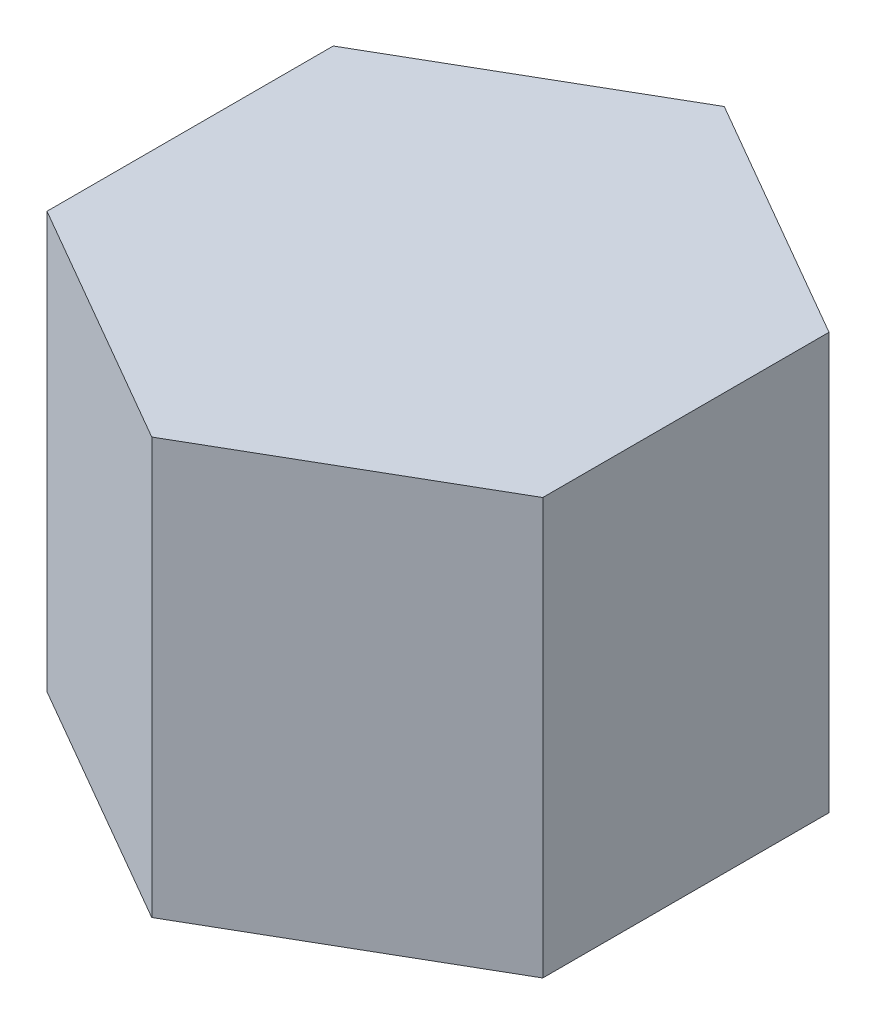
ISO-10303-21;
HEADER;
FILE_DESCRIPTION(('STEP AP214'),'2;1');
FILE_NAME('part.step','',(''),(''),'','','');
FILE_SCHEMA(('AUTOMOTIVE_DESIGN { 1 0 10303 214 1 1 1 1 }'));
ENDSEC;
DATA;
#1=APPLICATION_CONTEXT('core data for automotive mechanical design processes');
#2=APPLICATION_PROTOCOL_DEFINITION('international standard','automotive_design',2000,#1);
#3=PRODUCT_CONTEXT('',#1,'mechanical');
#4=PRODUCT('Part','Part','',(#3));
#5=PRODUCT_RELATED_PRODUCT_CATEGORY('part','',(#4));
#6=PRODUCT_DEFINITION_FORMATION('','',#4);
#7=PRODUCT_DEFINITION_CONTEXT('part definition',#1,'design');
#8=PRODUCT_DEFINITION('design','',#6,#7);
#9=PRODUCT_DEFINITION_SHAPE('','',#8);
#10=(LENGTH_UNIT() NAMED_UNIT(*) SI_UNIT(.MILLI.,.METRE.));
#11=(NAMED_UNIT(*) PLANE_ANGLE_UNIT() SI_UNIT($,.RADIAN.));
#12=(NAMED_UNIT(*) SI_UNIT($,.STERADIAN.) SOLID_ANGLE_UNIT());
#13=UNCERTAINTY_MEASURE_WITH_UNIT(LENGTH_MEASURE(1.E-05),#10,'distance_accuracy_value','');
#14=(GEOMETRIC_REPRESENTATION_CONTEXT(3) GLOBAL_UNCERTAINTY_ASSIGNED_CONTEXT((#13)) GLOBAL_UNIT_ASSIGNED_CONTEXT((#10,
#11,#12)) REPRESENTATION_CONTEXT('',''));
#15=CARTESIAN_POINT('',(0.,0.,0.));
#16=DIRECTION('',(0.,0.,1.));
#17=DIRECTION('',(1.,0.,0.));
#18=AXIS2_PLACEMENT_3D('',#15,#16,#17);
#19=CARTESIAN_POINT('',(208.839551417381,-147.556598747966,294.280047431848));
#20=DIRECTION('',(-0.500000000000062,0.,-0.866025403784403));
#21=DIRECTION('',(-0.866025403784403,0.,0.500000000000062));
#22=AXIS2_PLACEMENT_3D('',#19,#20,#21);
#23=PLANE('',#22);
#24=CARTESIAN_POINT('',(209.142660308706,-147.047793579175,294.105047431848));
#25=DIRECTION('',(-0.866025403784403,0.,0.500000000000062));
#26=VECTOR('',#25,1.);
#27=LINE('',#24,#26);
#28=CARTESIAN_POINT('',(209.142660308706,-147.047793579175,294.105047431848));
#29=VERTEX_POINT('',#28);
#30=CARTESIAN_POINT('',(208.839551417382,-147.047793579175,294.280047431848));
#31=VERTEX_POINT('',#30);
#32=EDGE_CURVE('E170',#29,#31,#27,.T.);
#33=ORIENTED_EDGE('',*,*,#32,.T.);
#34=CARTESIAN_POINT('',(208.839551417382,-147.556598747966,294.280047431848));
#35=DIRECTION('',(0.,1.,0.));
#36=VECTOR('',#35,1.);
#37=LINE('',#34,#36);
#38=CARTESIAN_POINT('',(208.839551417382,-147.556598747966,294.280047431848));
#39=VERTEX_POINT('',#38);
#40=EDGE_CURVE('E35',#39,#31,#37,.T.);
#41=ORIENTED_EDGE('',*,*,#40,.F.);
#42=CARTESIAN_POINT('',(209.142660308706,-147.556598747966,294.105047431848));
#43=DIRECTION('',(-0.866025403784403,0.,0.500000000000062));
#44=VECTOR('',#43,1.);
#45=LINE('',#42,#44);
#46=CARTESIAN_POINT('',(209.142660308706,-147.556598747966,294.105047431848));
#47=VERTEX_POINT('',#46);
#48=EDGE_CURVE('E159',#47,#39,#45,.T.);
#49=ORIENTED_EDGE('',*,*,#48,.F.);
#50=CARTESIAN_POINT('',(209.142660308706,-147.556598747966,294.105047431848));
#51=DIRECTION('',(0.,1.,0.));
#52=VECTOR('',#51,1.);
#53=LINE('',#50,#52);
#54=EDGE_CURVE('E10',#47,#29,#53,.T.);
#55=ORIENTED_EDGE('',*,*,#54,.T.);
#56=EDGE_LOOP('',(#33,#41,#49,#55));
#57=FACE_BOUND('',#56,.T.);
#58=ADVANCED_FACE('F16',(#57),#23,.F.);
#59=CARTESIAN_POINT('',(209.142660308706,-147.556598747966,291.594471220494));
#60=DIRECTION('',(-1.,0.,0.));
#61=DIRECTION('',(0.,-1.,0.));
#62=AXIS2_PLACEMENT_3D('',#59,#60,#61);
#63=PLANE('',#62);
#64=CARTESIAN_POINT('',(209.142660308706,-147.047793579175,293.755047431848));
#65=DIRECTION('',(0.,0.,1.));
#66=VECTOR('',#65,1.);
#67=LINE('',#64,#66);
#68=CARTESIAN_POINT('',(209.142660308706,-147.047793579175,293.755047431848));
#69=VERTEX_POINT('',#68);
#70=EDGE_CURVE('E167',#69,#29,#67,.T.);
#71=ORIENTED_EDGE('',*,*,#70,.T.);
#72=ORIENTED_EDGE('',*,*,#54,.F.);
#73=CARTESIAN_POINT('',(209.142660308706,-147.556598747966,293.755047431848));
#74=DIRECTION('',(0.,0.,1.));
#75=VECTOR('',#74,1.);
#76=LINE('',#73,#75);
#77=CARTESIAN_POINT('',(209.142660308706,-147.556598747966,293.755047431848));
#78=VERTEX_POINT('',#77);
#79=EDGE_CURVE('E156',#78,#47,#76,.T.);
#80=ORIENTED_EDGE('',*,*,#79,.F.);
#81=CARTESIAN_POINT('',(209.142660308706,-147.556598747966,293.755047431848));
#82=DIRECTION('',(0.,1.,0.));
#83=VECTOR('',#82,1.);
#84=LINE('',#81,#83);
#85=EDGE_CURVE('E27',#78,#69,#84,.T.);
#86=ORIENTED_EDGE('',*,*,#85,.T.);
#87=EDGE_LOOP('',(#71,#72,#80,#86));
#88=FACE_BOUND('',#87,.T.);
#89=ADVANCED_FACE('F189',(#88),#63,.F.);
#90=CARTESIAN_POINT('',(209.142660308706,-147.556598747966,293.755047431848));
#91=DIRECTION('',(-0.500000000000096,0.,0.866025403784383));
#92=DIRECTION('',(0.866025403784383,0.,0.500000000000096));
#93=AXIS2_PLACEMENT_3D('',#90,#91,#92);
#94=PLANE('',#93);
#95=CARTESIAN_POINT('',(208.839551417382,-147.047793579175,293.580047431848));
#96=DIRECTION('',(0.866025403784383,0.,0.500000000000096));
#97=VECTOR('',#96,1.);
#98=LINE('',#95,#97);
#99=CARTESIAN_POINT('',(208.839551417382,-147.047793579175,293.580047431848));
#100=VERTEX_POINT('',#99);
#101=EDGE_CURVE('E163',#100,#69,#98,.T.);
#102=ORIENTED_EDGE('',*,*,#101,.T.);
#103=ORIENTED_EDGE('',*,*,#85,.F.);
#104=CARTESIAN_POINT('',(208.839551417382,-147.556598747966,293.580047431848));
#105=DIRECTION('',(0.866025403784383,0.,0.500000000000096));
#106=VECTOR('',#105,1.);
#107=LINE('',#104,#106);
#108=CARTESIAN_POINT('',(208.839551417382,-147.556598747966,293.580047431848));
#109=VERTEX_POINT('',#108);
#110=EDGE_CURVE('E106',#109,#78,#107,.T.);
#111=ORIENTED_EDGE('',*,*,#110,.F.);
#112=CARTESIAN_POINT('',(208.839551417382,-147.556598747966,293.580047431848));
#113=DIRECTION('',(0.,1.,0.));
#114=VECTOR('',#113,1.);
#115=LINE('',#112,#114);
#116=EDGE_CURVE('E94',#109,#100,#115,.T.);
#117=ORIENTED_EDGE('',*,*,#116,.T.);
#118=EDGE_LOOP('',(#102,#103,#111,#117));
#119=FACE_BOUND('',#118,.T.);
#120=ADVANCED_FACE('F198',(#119),#94,.F.);
#121=CARTESIAN_POINT('',(208.839551417382,-147.556598747966,293.580047431848));
#122=DIRECTION('',(0.499999999999978,0.,0.866025403784452));
#123=DIRECTION('',(0.866025403784452,0.,-0.499999999999978));
#124=AXIS2_PLACEMENT_3D('',#121,#122,#123);
#125=PLANE('',#124);
#126=CARTESIAN_POINT('',(208.536442526057,-147.047793579175,293.755047431848));
#127=DIRECTION('',(0.866025403784452,0.,-0.499999999999978));
#128=VECTOR('',#127,1.);
#129=LINE('',#126,#128);
#130=CARTESIAN_POINT('',(208.536442526057,-147.047793579175,293.755047431848));
#131=VERTEX_POINT('',#130);
#132=EDGE_CURVE('E162',#131,#100,#129,.T.);
#133=ORIENTED_EDGE('',*,*,#132,.T.);
#134=ORIENTED_EDGE('',*,*,#116,.F.);
#135=CARTESIAN_POINT('',(208.536442526057,-147.556598747966,293.755047431848));
#136=DIRECTION('',(0.866025403784452,0.,-0.499999999999978));
#137=VECTOR('',#136,1.);
#138=LINE('',#135,#137);
#139=CARTESIAN_POINT('',(208.536442526057,-147.556598747966,293.755047431848));
#140=VERTEX_POINT('',#139);
#141=EDGE_CURVE('E98',#140,#109,#138,.T.);
#142=ORIENTED_EDGE('',*,*,#141,.F.);
#143=CARTESIAN_POINT('',(208.536442526057,-147.556598747966,293.755047431848));
#144=DIRECTION('',(0.,1.,0.));
#145=VECTOR('',#144,1.);
#146=LINE('',#143,#145);
#147=EDGE_CURVE('E79',#140,#131,#146,.T.);
#148=ORIENTED_EDGE('',*,*,#147,.T.);
#149=EDGE_LOOP('',(#133,#134,#142,#148));
#150=FACE_BOUND('',#149,.T.);
#151=ADVANCED_FACE('F100',(#150),#125,.F.);
#152=CARTESIAN_POINT('',(208.536442526057,-147.556598747966,291.594471220494));
#153=DIRECTION('',(1.,0.,0.));
#154=DIRECTION('',(0.,1.,0.));
#155=AXIS2_PLACEMENT_3D('',#152,#153,#154);
#156=PLANE('',#155);
#157=CARTESIAN_POINT('',(208.536442526057,-147.047793579175,294.105047431848));
#158=DIRECTION('',(0.,0.,-1.));
#159=VECTOR('',#158,1.);
#160=LINE('',#157,#159);
#161=CARTESIAN_POINT('',(208.536442526057,-147.047793579175,294.105047431848));
#162=VERTEX_POINT('',#161);
#163=EDGE_CURVE('E88',#162,#131,#160,.T.);
#164=ORIENTED_EDGE('',*,*,#163,.T.);
#165=ORIENTED_EDGE('',*,*,#147,.F.);
#166=CARTESIAN_POINT('',(208.536442526057,-147.556598747966,294.105047431848));
#167=DIRECTION('',(0.,0.,-1.));
#168=VECTOR('',#167,1.);
#169=LINE('',#166,#168);
#170=CARTESIAN_POINT('',(208.536442526057,-147.556598747966,294.105047431848));
#171=VERTEX_POINT('',#170);
#172=EDGE_CURVE('E84',#171,#140,#169,.T.);
#173=ORIENTED_EDGE('',*,*,#172,.F.);
#174=CARTESIAN_POINT('',(208.536442526057,-147.556598747966,294.105047431848));
#175=DIRECTION('',(0.,1.,0.));
#176=VECTOR('',#175,1.);
#177=LINE('',#174,#176);
#178=EDGE_CURVE('E58',#171,#162,#177,.T.);
#179=ORIENTED_EDGE('',*,*,#178,.T.);
#180=EDGE_LOOP('',(#164,#165,#173,#179));
#181=FACE_BOUND('',#180,.T.);
#182=ADVANCED_FACE('F82',(#181),#156,.F.);
#183=CARTESIAN_POINT('',(208.536442526057,-147.556598747966,294.105047431848));
#184=DIRECTION('',(0.500000000000062,0.,-0.866025403784403));
#185=DIRECTION('',(-0.866025403784403,0.,-0.500000000000062));
#186=AXIS2_PLACEMENT_3D('',#183,#184,#185);
#187=PLANE('',#186);
#188=CARTESIAN_POINT('',(208.839551417382,-147.047793579175,294.280047431848));
#189=DIRECTION('',(-0.866025403784403,0.,-0.500000000000062));
#190=VECTOR('',#189,1.);
#191=LINE('',#188,#190);
#192=EDGE_CURVE('E160',#31,#162,#191,.T.);
#193=ORIENTED_EDGE('',*,*,#192,.T.);
#194=ORIENTED_EDGE('',*,*,#178,.F.);
#195=CARTESIAN_POINT('',(208.839551417382,-147.556598747966,294.280047431848));
#196=DIRECTION('',(-0.866025403784403,0.,-0.500000000000062));
#197=VECTOR('',#196,1.);
#198=LINE('',#195,#197);
#199=EDGE_CURVE('E112',#39,#171,#198,.T.);
#200=ORIENTED_EDGE('',*,*,#199,.F.);
#201=ORIENTED_EDGE('',*,*,#40,.T.);
#202=EDGE_LOOP('',(#193,#194,#200,#201));
#203=FACE_BOUND('',#202,.T.);
#204=ADVANCED_FACE('F131',(#203),#187,.F.);
#205=CARTESIAN_POINT('',(206.491105863044,-147.556598747966,291.594471220494));
#206=DIRECTION('',(0.,1.,0.));
#207=DIRECTION('',(-1.,0.,0.));
#208=AXIS2_PLACEMENT_3D('',#205,#206,#207);
#209=PLANE('',#208);
#210=ORIENTED_EDGE('',*,*,#48,.T.);
#211=ORIENTED_EDGE('',*,*,#199,.T.);
#212=ORIENTED_EDGE('',*,*,#172,.T.);
#213=ORIENTED_EDGE('',*,*,#141,.T.);
#214=ORIENTED_EDGE('',*,*,#110,.T.);
#215=ORIENTED_EDGE('',*,*,#79,.T.);
#216=EDGE_LOOP('',(#210,#211,#212,#213,#214,#215));
#217=FACE_BOUND('',#216,.T.);
#218=ADVANCED_FACE('F111',(#217),#209,.F.);
#219=CARTESIAN_POINT('',(206.491105863044,-147.047793579175,291.594471220494));
#220=DIRECTION('',(0.,1.,0.));
#221=DIRECTION('',(-1.,0.,0.));
#222=AXIS2_PLACEMENT_3D('',#219,#220,#221);
#223=PLANE('',#222);
#224=ORIENTED_EDGE('',*,*,#32,.F.);
#225=ORIENTED_EDGE('',*,*,#70,.F.);
#226=ORIENTED_EDGE('',*,*,#101,.F.);
#227=ORIENTED_EDGE('',*,*,#132,.F.);
#228=ORIENTED_EDGE('',*,*,#163,.F.);
#229=ORIENTED_EDGE('',*,*,#192,.F.);
#230=EDGE_LOOP('',(#224,#225,#226,#227,#228,#229));
#231=FACE_BOUND('',#230,.T.);
#232=ADVANCED_FACE('F130',(#231),#223,.T.);
#233=CLOSED_SHELL('',(#58,#89,#120,#151,#182,#204,#218,#232));
#234=MANIFOLD_SOLID_BREP('B1',#233);
#235=ADVANCED_BREP_SHAPE_REPRESENTATION('',(#18,#234),#14);
#236=SHAPE_DEFINITION_REPRESENTATION(#9,#235);
ENDSEC;
END-ISO-10303-21;
